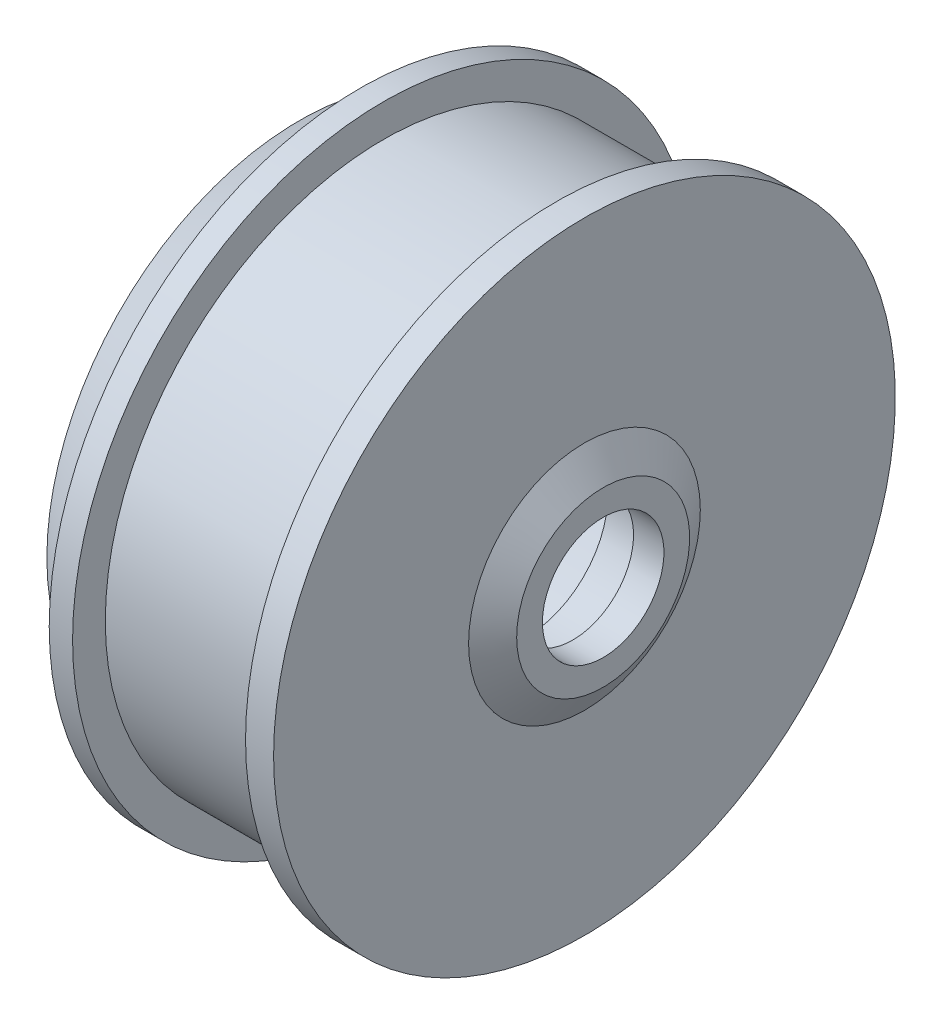
ISO-10303-21;
HEADER;
FILE_DESCRIPTION(('STEP AP214'),'2;1');
FILE_NAME('part.step','',(''),(''),'','','');
FILE_SCHEMA(('AUTOMOTIVE_DESIGN { 1 0 10303 214 1 1 1 1 }'));
ENDSEC;
DATA;
#1=APPLICATION_CONTEXT('core data for automotive mechanical design processes');
#2=APPLICATION_PROTOCOL_DEFINITION('international standard','automotive_design',2000,#1);
#3=PRODUCT_CONTEXT('',#1,'mechanical');
#4=PRODUCT('Part','Part','',(#3));
#5=PRODUCT_RELATED_PRODUCT_CATEGORY('part','',(#4));
#6=PRODUCT_DEFINITION_FORMATION('','',#4);
#7=PRODUCT_DEFINITION_CONTEXT('part definition',#1,'design');
#8=PRODUCT_DEFINITION('design','',#6,#7);
#9=PRODUCT_DEFINITION_SHAPE('','',#8);
#10=(LENGTH_UNIT() NAMED_UNIT(*) SI_UNIT(.MILLI.,.METRE.));
#11=(NAMED_UNIT(*) PLANE_ANGLE_UNIT() SI_UNIT($,.RADIAN.));
#12=(NAMED_UNIT(*) SI_UNIT($,.STERADIAN.) SOLID_ANGLE_UNIT());
#13=UNCERTAINTY_MEASURE_WITH_UNIT(LENGTH_MEASURE(1.E-05),#10,'distance_accuracy_value','');
#14=(GEOMETRIC_REPRESENTATION_CONTEXT(3) GLOBAL_UNCERTAINTY_ASSIGNED_CONTEXT((#13)) GLOBAL_UNIT_ASSIGNED_CONTEXT((#10,
#11,#12)) REPRESENTATION_CONTEXT('',''));
#15=CARTESIAN_POINT('',(0.,0.,0.));
#16=DIRECTION('',(0.,0.,1.));
#17=DIRECTION('',(1.,0.,0.));
#18=AXIS2_PLACEMENT_3D('',#15,#16,#17);
#19=CARTESIAN_POINT('',(22.5,0.,0.));
#20=DIRECTION('',(1.,0.,0.));
#21=DIRECTION('',(0.,0.,-1.));
#22=AXIS2_PLACEMENT_3D('',#19,#20,#21);
#23=PLANE('',#22);
#24=CARTESIAN_POINT('',(22.5,0.,0.));
#25=DIRECTION('',(-1.,0.,0.));
#26=DIRECTION('',(0.,0.,1.));
#27=AXIS2_PLACEMENT_3D('',#24,#25,#26);
#28=CIRCLE('',#27,13.);
#29=CARTESIAN_POINT('',(22.5,0.,13.));
#30=VERTEX_POINT('',#29);
#31=EDGE_CURVE('E11',#30,#30,#28,.T.);
#32=ORIENTED_EDGE('',*,*,#31,.F.);
#33=EDGE_LOOP('',(#32));
#34=FACE_BOUND('',#33,.T.);
#35=CARTESIAN_POINT('',(22.5,0.,0.));
#36=DIRECTION('',(-1.,0.,0.));
#37=DIRECTION('',(0.,0.,1.));
#38=AXIS2_PLACEMENT_3D('',#35,#36,#37);
#39=CIRCLE('',#38,17.5);
#40=CARTESIAN_POINT('',(22.5,0.,17.5));
#41=VERTEX_POINT('',#40);
#42=EDGE_CURVE('E89',#41,#41,#39,.T.);
#43=ORIENTED_EDGE('',*,*,#42,.T.);
#44=EDGE_LOOP('',(#43));
#45=FACE_BOUND('',#44,.T.);
#46=ADVANCED_FACE('F40',(#34,#45),#23,.F.);
#47=CARTESIAN_POINT('',(-84.605982481995,0.,0.));
#48=DIRECTION('',(-1.,0.,0.));
#49=DIRECTION('',(0.,0.,1.));
#50=AXIS2_PLACEMENT_3D('',#47,#48,#49);
#51=CYLINDRICAL_SURFACE('',#50,13.);
#52=CARTESIAN_POINT('',(29.,0.,0.));
#53=DIRECTION('',(-1.,0.,0.));
#54=DIRECTION('',(0.,0.,1.));
#55=AXIS2_PLACEMENT_3D('',#52,#53,#54);
#56=CIRCLE('',#55,13.);
#57=CARTESIAN_POINT('',(29.,0.,13.));
#58=VERTEX_POINT('',#57);
#59=EDGE_CURVE('E46',#58,#58,#56,.T.);
#60=ORIENTED_EDGE('',*,*,#59,.F.);
#61=EDGE_LOOP('',(#60));
#62=FACE_BOUND('',#61,.T.);
#63=ORIENTED_EDGE('',*,*,#31,.T.);
#64=EDGE_LOOP('',(#63));
#65=FACE_BOUND('',#64,.T.);
#66=ADVANCED_FACE('F118',(#62,#65),#51,.F.);
#67=CARTESIAN_POINT('',(29.,0.,0.));
#68=DIRECTION('',(-1.,0.,0.));
#69=DIRECTION('',(0.,0.,1.));
#70=AXIS2_PLACEMENT_3D('',#67,#68,#69);
#71=PLANE('',#70);
#72=CARTESIAN_POINT('',(29.,0.,0.));
#73=DIRECTION('',(-1.,0.,0.));
#74=DIRECTION('',(0.,0.,1.));
#75=AXIS2_PLACEMENT_3D('',#72,#73,#74);
#76=CIRCLE('',#75,18.5);
#77=CARTESIAN_POINT('',(29.,0.,18.5));
#78=VERTEX_POINT('',#77);
#79=EDGE_CURVE('E50',#78,#78,#76,.T.);
#80=ORIENTED_EDGE('',*,*,#79,.F.);
#81=EDGE_LOOP('',(#80));
#82=FACE_BOUND('',#81,.T.);
#83=ORIENTED_EDGE('',*,*,#59,.T.);
#84=EDGE_LOOP('',(#83));
#85=FACE_BOUND('',#84,.T.);
#86=ADVANCED_FACE('F123',(#82,#85),#71,.F.);
#87=CARTESIAN_POINT('',(29.,0.,0.));
#88=DIRECTION('',(-1.,0.,0.));
#89=DIRECTION('',(0.,0.,1.));
#90=AXIS2_PLACEMENT_3D('',#87,#88,#89);
#91=CONICAL_SURFACE('',#90,18.5,1.00406710927139);
#92=CARTESIAN_POINT('',(25.,0.,0.));
#93=DIRECTION('',(-1.,0.,0.));
#94=DIRECTION('',(0.,0.,1.));
#95=AXIS2_PLACEMENT_3D('',#92,#93,#94);
#96=CIRCLE('',#95,24.7857142857143);
#97=CARTESIAN_POINT('',(25.,0.,24.7857142857143));
#98=VERTEX_POINT('',#97);
#99=EDGE_CURVE('E54',#98,#98,#96,.T.);
#100=ORIENTED_EDGE('',*,*,#99,.F.);
#101=EDGE_LOOP('',(#100));
#102=FACE_BOUND('',#101,.T.);
#103=ORIENTED_EDGE('',*,*,#79,.T.);
#104=EDGE_LOOP('',(#103));
#105=FACE_BOUND('',#104,.T.);
#106=ADVANCED_FACE('F128',(#102,#105),#91,.T.);
#107=CARTESIAN_POINT('',(25.,0.,0.));
#108=DIRECTION('',(-1.,0.,0.));
#109=DIRECTION('',(0.,0.,1.));
#110=AXIS2_PLACEMENT_3D('',#107,#108,#109);
#111=PLANE('',#110);
#112=CARTESIAN_POINT('',(25.,0.,0.));
#113=DIRECTION('',(-1.,0.,0.));
#114=DIRECTION('',(0.,0.,1.));
#115=AXIS2_PLACEMENT_3D('',#112,#113,#114);
#116=CIRCLE('',#115,66.5);
#117=CARTESIAN_POINT('',(25.,0.,66.5));
#118=VERTEX_POINT('',#117);
#119=EDGE_CURVE('E59',#118,#118,#116,.T.);
#120=ORIENTED_EDGE('',*,*,#119,.F.);
#121=EDGE_LOOP('',(#120));
#122=FACE_BOUND('',#121,.T.);
#123=ORIENTED_EDGE('',*,*,#99,.T.);
#124=EDGE_LOOP('',(#123));
#125=FACE_BOUND('',#124,.T.);
#126=ADVANCED_FACE('F134',(#122,#125),#111,.F.);
#127=CARTESIAN_POINT('',(-84.605982481995,0.,0.));
#128=DIRECTION('',(-1.,0.,0.));
#129=DIRECTION('',(0.,0.,1.));
#130=AXIS2_PLACEMENT_3D('',#127,#128,#129);
#131=CYLINDRICAL_SURFACE('',#130,66.5);
#132=CARTESIAN_POINT('',(19.,0.,0.));
#133=DIRECTION('',(-1.,0.,0.));
#134=DIRECTION('',(0.,0.,1.));
#135=AXIS2_PLACEMENT_3D('',#132,#133,#134);
#136=CIRCLE('',#135,66.5);
#137=CARTESIAN_POINT('',(19.,0.,66.5));
#138=VERTEX_POINT('',#137);
#139=EDGE_CURVE('E62',#138,#138,#136,.T.);
#140=ORIENTED_EDGE('',*,*,#139,.F.);
#141=EDGE_LOOP('',(#140));
#142=FACE_BOUND('',#141,.T.);
#143=ORIENTED_EDGE('',*,*,#119,.T.);
#144=EDGE_LOOP('',(#143));
#145=FACE_BOUND('',#144,.T.);
#146=ADVANCED_FACE('F138',(#142,#145),#131,.T.);
#147=CARTESIAN_POINT('',(19.,0.,0.));
#148=DIRECTION('',(1.,0.,0.));
#149=DIRECTION('',(0.,0.,-1.));
#150=AXIS2_PLACEMENT_3D('',#147,#148,#149);
#151=PLANE('',#150);
#152=CARTESIAN_POINT('',(19.,0.,0.));
#153=DIRECTION('',(-1.,0.,0.));
#154=DIRECTION('',(0.,0.,1.));
#155=AXIS2_PLACEMENT_3D('',#152,#153,#154);
#156=CIRCLE('',#155,53.);
#157=CARTESIAN_POINT('',(19.,0.,53.));
#158=VERTEX_POINT('',#157);
#159=EDGE_CURVE('E65',#158,#158,#156,.T.);
#160=ORIENTED_EDGE('',*,*,#159,.F.);
#161=EDGE_LOOP('',(#160));
#162=FACE_BOUND('',#161,.T.);
#163=ORIENTED_EDGE('',*,*,#139,.T.);
#164=EDGE_LOOP('',(#163));
#165=FACE_BOUND('',#164,.T.);
#166=ADVANCED_FACE('F142',(#162,#165),#151,.F.);
#167=CARTESIAN_POINT('',(-84.605982481995,0.,0.));
#168=DIRECTION('',(-1.,0.,0.));
#169=DIRECTION('',(0.,0.,1.));
#170=AXIS2_PLACEMENT_3D('',#167,#168,#169);
#171=CYLINDRICAL_SURFACE('',#170,53.);
#172=CARTESIAN_POINT('',(15.5,0.,0.));
#173=DIRECTION('',(-1.,0.,0.));
#174=DIRECTION('',(0.,0.,1.));
#175=AXIS2_PLACEMENT_3D('',#172,#173,#174);
#176=CIRCLE('',#175,53.);
#177=CARTESIAN_POINT('',(15.5,0.,53.));
#178=VERTEX_POINT('',#177);
#179=EDGE_CURVE('E68',#178,#178,#176,.T.);
#180=ORIENTED_EDGE('',*,*,#179,.F.);
#181=EDGE_LOOP('',(#180));
#182=FACE_BOUND('',#181,.T.);
#183=ORIENTED_EDGE('',*,*,#159,.T.);
#184=EDGE_LOOP('',(#183));
#185=FACE_BOUND('',#184,.T.);
#186=ADVANCED_FACE('F146',(#182,#185),#171,.T.);
#187=CARTESIAN_POINT('',(15.5,0.,0.));
#188=DIRECTION('',(1.,0.,0.));
#189=DIRECTION('',(0.,0.,-1.));
#190=AXIS2_PLACEMENT_3D('',#187,#188,#189);
#191=PLANE('',#190);
#192=CARTESIAN_POINT('',(15.5,0.,0.));
#193=DIRECTION('',(-1.,0.,0.));
#194=DIRECTION('',(0.,0.,1.));
#195=AXIS2_PLACEMENT_3D('',#192,#193,#194);
#196=CIRCLE('',#195,50.5);
#197=CARTESIAN_POINT('',(15.5,0.,50.5));
#198=VERTEX_POINT('',#197);
#199=EDGE_CURVE('E71',#198,#198,#196,.T.);
#200=ORIENTED_EDGE('',*,*,#199,.F.);
#201=EDGE_LOOP('',(#200));
#202=FACE_BOUND('',#201,.T.);
#203=ORIENTED_EDGE('',*,*,#179,.T.);
#204=EDGE_LOOP('',(#203));
#205=FACE_BOUND('',#204,.T.);
#206=ADVANCED_FACE('F150',(#202,#205),#191,.F.);
#207=CARTESIAN_POINT('',(-84.605982481995,0.,0.));
#208=DIRECTION('',(-1.,0.,0.));
#209=DIRECTION('',(0.,0.,1.));
#210=AXIS2_PLACEMENT_3D('',#207,#208,#209);
#211=CYLINDRICAL_SURFACE('',#210,50.5);
#212=CARTESIAN_POINT('',(22.5,0.,0.));
#213=DIRECTION('',(-1.,0.,0.));
#214=DIRECTION('',(0.,0.,1.));
#215=AXIS2_PLACEMENT_3D('',#212,#213,#214);
#216=CIRCLE('',#215,50.5);
#217=CARTESIAN_POINT('',(22.5,0.,50.5));
#218=VERTEX_POINT('',#217);
#219=EDGE_CURVE('E74',#218,#218,#216,.T.);
#220=ORIENTED_EDGE('',*,*,#219,.F.);
#221=EDGE_LOOP('',(#220));
#222=FACE_BOUND('',#221,.T.);
#223=ORIENTED_EDGE('',*,*,#199,.T.);
#224=EDGE_LOOP('',(#223));
#225=FACE_BOUND('',#224,.T.);
#226=ADVANCED_FACE('F154',(#222,#225),#211,.F.);
#227=CARTESIAN_POINT('',(22.5,0.,0.));
#228=DIRECTION('',(1.,0.,0.));
#229=DIRECTION('',(0.,0.,-1.));
#230=AXIS2_PLACEMENT_3D('',#227,#228,#229);
#231=PLANE('',#230);
#232=CARTESIAN_POINT('',(22.5,0.,0.));
#233=DIRECTION('',(-1.,0.,0.));
#234=DIRECTION('',(0.,0.,1.));
#235=AXIS2_PLACEMENT_3D('',#232,#233,#234);
#236=CIRCLE('',#235,22.5);
#237=CARTESIAN_POINT('',(22.5,0.,22.5));
#238=VERTEX_POINT('',#237);
#239=EDGE_CURVE('E77',#238,#238,#236,.T.);
#240=ORIENTED_EDGE('',*,*,#239,.F.);
#241=EDGE_LOOP('',(#240));
#242=FACE_BOUND('',#241,.T.);
#243=ORIENTED_EDGE('',*,*,#219,.T.);
#244=EDGE_LOOP('',(#243));
#245=FACE_BOUND('',#244,.T.);
#246=ADVANCED_FACE('F114',(#242,#245),#231,.F.);
#247=CARTESIAN_POINT('',(-84.605982481995,0.,0.));
#248=DIRECTION('',(-1.,0.,0.));
#249=DIRECTION('',(0.,0.,1.));
#250=AXIS2_PLACEMENT_3D('',#247,#248,#249);
#251=CYLINDRICAL_SURFACE('',#250,22.5);
#252=ORIENTED_EDGE('',*,*,#239,.T.);
#253=EDGE_LOOP('',(#252));
#254=FACE_BOUND('',#253,.T.);
#255=CARTESIAN_POINT('',(18.,0.,0.));
#256=DIRECTION('',(-1.,0.,0.));
#257=DIRECTION('',(0.,0.,1.));
#258=AXIS2_PLACEMENT_3D('',#255,#256,#257);
#259=CIRCLE('',#258,22.5);
#260=CARTESIAN_POINT('',(18.,0.,22.5));
#261=VERTEX_POINT('',#260);
#262=EDGE_CURVE('E80',#261,#261,#259,.T.);
#263=ORIENTED_EDGE('',*,*,#262,.F.);
#264=EDGE_LOOP('',(#263));
#265=FACE_BOUND('',#264,.T.);
#266=ADVANCED_FACE('F108',(#254,#265),#251,.T.);
#267=CARTESIAN_POINT('',(12.5,0.,0.));
#268=DIRECTION('',(1.,0.,0.));
#269=DIRECTION('',(0.,0.,-1.));
#270=AXIS2_PLACEMENT_3D('',#267,#268,#269);
#271=CONICAL_SURFACE('',#270,19.,0.566729217523506);
#272=ORIENTED_EDGE('',*,*,#262,.T.);
#273=EDGE_LOOP('',(#272));
#274=FACE_BOUND('',#273,.T.);
#275=CARTESIAN_POINT('',(12.5,0.,0.));
#276=DIRECTION('',(-1.,0.,0.));
#277=DIRECTION('',(0.,0.,1.));
#278=AXIS2_PLACEMENT_3D('',#275,#276,#277);
#279=CIRCLE('',#278,19.);
#280=CARTESIAN_POINT('',(12.5,0.,19.));
#281=VERTEX_POINT('',#280);
#282=EDGE_CURVE('E83',#281,#281,#279,.T.);
#283=ORIENTED_EDGE('',*,*,#282,.F.);
#284=EDGE_LOOP('',(#283));
#285=FACE_BOUND('',#284,.T.);
#286=ADVANCED_FACE('F103',(#274,#285),#271,.T.);
#287=CARTESIAN_POINT('',(12.5,0.,0.));
#288=DIRECTION('',(1.,0.,0.));
#289=DIRECTION('',(0.,0.,-1.));
#290=AXIS2_PLACEMENT_3D('',#287,#288,#289);
#291=PLANE('',#290);
#292=CARTESIAN_POINT('',(12.5,0.,0.));
#293=DIRECTION('',(-1.,0.,0.));
#294=DIRECTION('',(0.,0.,1.));
#295=AXIS2_PLACEMENT_3D('',#292,#293,#294);
#296=CIRCLE('',#295,17.5);
#297=CARTESIAN_POINT('',(12.5,0.,17.5));
#298=VERTEX_POINT('',#297);
#299=EDGE_CURVE('E86',#298,#298,#296,.T.);
#300=ORIENTED_EDGE('',*,*,#299,.F.);
#301=EDGE_LOOP('',(#300));
#302=FACE_BOUND('',#301,.T.);
#303=ORIENTED_EDGE('',*,*,#282,.T.);
#304=EDGE_LOOP('',(#303));
#305=FACE_BOUND('',#304,.T.);
#306=ADVANCED_FACE('F97',(#302,#305),#291,.F.);
#307=CARTESIAN_POINT('',(-84.605982481995,0.,0.));
#308=DIRECTION('',(-1.,0.,0.));
#309=DIRECTION('',(0.,0.,1.));
#310=AXIS2_PLACEMENT_3D('',#307,#308,#309);
#311=CYLINDRICAL_SURFACE('',#310,17.5);
#312=ORIENTED_EDGE('',*,*,#42,.F.);
#313=EDGE_LOOP('',(#312));
#314=FACE_BOUND('',#313,.T.);
#315=ORIENTED_EDGE('',*,*,#299,.T.);
#316=EDGE_LOOP('',(#315));
#317=FACE_BOUND('',#316,.T.);
#318=ADVANCED_FACE('F94',(#314,#317),#311,.F.);
#319=CLOSED_SHELL('',(#46,#66,#86,#106,#126,#146,#166,#186,#206,#226,#246,#266,#286,#306,#318));
#320=MANIFOLD_SOLID_BREP('B2',#319);
#321=CARTESIAN_POINT('',(19.,59.5,0.));
#322=DIRECTION('',(1.,0.,0.));
#323=DIRECTION('',(0.,0.,-1.));
#324=AXIS2_PLACEMENT_3D('',#321,#322,#323);
#325=PLANE('',#324);
#326=CARTESIAN_POINT('',(19.,0.,0.));
#327=DIRECTION('',(-1.,0.,0.));
#328=DIRECTION('',(0.,0.,1.));
#329=AXIS2_PLACEMENT_3D('',#326,#327,#328);
#330=CIRCLE('',#329,53.);
#331=CARTESIAN_POINT('',(19.,0.,53.));
#332=VERTEX_POINT('',#331);
#333=EDGE_CURVE('E39',#332,#332,#330,.T.);
#334=ORIENTED_EDGE('',*,*,#333,.T.);
#335=EDGE_LOOP('',(#334));
#336=FACE_BOUND('',#335,.T.);
#337=CARTESIAN_POINT('',(19.,0.,0.));
#338=DIRECTION('',(-1.,0.,0.));
#339=DIRECTION('',(0.,0.,1.));
#340=AXIS2_PLACEMENT_3D('',#337,#338,#339);
#341=CIRCLE('',#340,59.5);
#342=CARTESIAN_POINT('',(19.,0.,59.5));
#343=VERTEX_POINT('',#342);
#344=EDGE_CURVE('E315',#343,#343,#341,.T.);
#345=ORIENTED_EDGE('',*,*,#344,.F.);
#346=EDGE_LOOP('',(#345));
#347=FACE_BOUND('',#346,.T.);
#348=ADVANCED_FACE('F269',(#336,#347),#325,.T.);
#349=CARTESIAN_POINT('',(-84.605982481995,0.,0.));
#350=DIRECTION('',(-1.,0.,0.));
#351=DIRECTION('',(0.,0.,1.));
#352=AXIS2_PLACEMENT_3D('',#349,#350,#351);
#353=CYLINDRICAL_SURFACE('',#352,53.);
#354=CARTESIAN_POINT('',(-28.,0.,0.));
#355=DIRECTION('',(-1.,0.,0.));
#356=DIRECTION('',(0.,0.,1.));
#357=AXIS2_PLACEMENT_3D('',#354,#355,#356);
#358=CIRCLE('',#357,53.);
#359=CARTESIAN_POINT('',(-28.,0.,53.));
#360=VERTEX_POINT('',#359);
#361=EDGE_CURVE('E275',#360,#360,#358,.T.);
#362=ORIENTED_EDGE('',*,*,#361,.T.);
#363=EDGE_LOOP('',(#362));
#364=FACE_BOUND('',#363,.T.);
#365=ORIENTED_EDGE('',*,*,#333,.F.);
#366=EDGE_LOOP('',(#365));
#367=FACE_BOUND('',#366,.T.);
#368=ADVANCED_FACE('F323',(#364,#367),#353,.F.);
#369=CARTESIAN_POINT('',(-28.,53.,0.));
#370=DIRECTION('',(1.,0.,0.));
#371=DIRECTION('',(0.,0.,-1.));
#372=AXIS2_PLACEMENT_3D('',#369,#370,#371);
#373=PLANE('',#372);
#374=CARTESIAN_POINT('',(-28.,0.,0.));
#375=DIRECTION('',(-1.,0.,0.));
#376=DIRECTION('',(0.,0.,1.));
#377=AXIS2_PLACEMENT_3D('',#374,#375,#376);
#378=CIRCLE('',#377,22.5);
#379=CARTESIAN_POINT('',(-28.,0.,22.5));
#380=VERTEX_POINT('',#379);
#381=EDGE_CURVE('E279',#380,#380,#378,.T.);
#382=ORIENTED_EDGE('',*,*,#381,.T.);
#383=EDGE_LOOP('',(#382));
#384=FACE_BOUND('',#383,.T.);
#385=ORIENTED_EDGE('',*,*,#361,.F.);
#386=EDGE_LOOP('',(#385));
#387=FACE_BOUND('',#386,.T.);
#388=ADVANCED_FACE('F327',(#384,#387),#373,.T.);
#389=CARTESIAN_POINT('',(-84.605982481995,0.,0.));
#390=DIRECTION('',(-1.,0.,0.));
#391=DIRECTION('',(0.,0.,1.));
#392=AXIS2_PLACEMENT_3D('',#389,#390,#391);
#393=CYLINDRICAL_SURFACE('',#392,22.5);
#394=CARTESIAN_POINT('',(-14.5,0.,0.));
#395=DIRECTION('',(-1.,0.,0.));
#396=DIRECTION('',(0.,0.,1.));
#397=AXIS2_PLACEMENT_3D('',#394,#395,#396);
#398=CIRCLE('',#397,22.5);
#399=CARTESIAN_POINT('',(-14.5,0.,22.5));
#400=VERTEX_POINT('',#399);
#401=EDGE_CURVE('E283',#400,#400,#398,.T.);
#402=ORIENTED_EDGE('',*,*,#401,.T.);
#403=EDGE_LOOP('',(#402));
#404=FACE_BOUND('',#403,.T.);
#405=ORIENTED_EDGE('',*,*,#381,.F.);
#406=EDGE_LOOP('',(#405));
#407=FACE_BOUND('',#406,.T.);
#408=ADVANCED_FACE('F331',(#404,#407),#393,.T.);
#409=CARTESIAN_POINT('',(-14.5,22.5,0.));
#410=DIRECTION('',(1.,0.,0.));
#411=DIRECTION('',(0.,0.,-1.));
#412=AXIS2_PLACEMENT_3D('',#409,#410,#411);
#413=PLANE('',#412);
#414=CARTESIAN_POINT('',(-14.5,0.,0.));
#415=DIRECTION('',(-1.,0.,0.));
#416=DIRECTION('',(0.,0.,1.));
#417=AXIS2_PLACEMENT_3D('',#414,#415,#416);
#418=CIRCLE('',#417,17.5);
#419=CARTESIAN_POINT('',(-14.5,0.,17.5));
#420=VERTEX_POINT('',#419);
#421=EDGE_CURVE('E288',#420,#420,#418,.T.);
#422=ORIENTED_EDGE('',*,*,#421,.T.);
#423=EDGE_LOOP('',(#422));
#424=FACE_BOUND('',#423,.T.);
#425=ORIENTED_EDGE('',*,*,#401,.F.);
#426=EDGE_LOOP('',(#425));
#427=FACE_BOUND('',#426,.T.);
#428=ADVANCED_FACE('F338',(#424,#427),#413,.T.);
#429=CARTESIAN_POINT('',(-84.605982481995,0.,0.));
#430=DIRECTION('',(-1.,0.,0.));
#431=DIRECTION('',(0.,0.,1.));
#432=AXIS2_PLACEMENT_3D('',#429,#430,#431);
#433=CYLINDRICAL_SURFACE('',#432,17.5);
#434=CARTESIAN_POINT('',(-24.5,0.,0.));
#435=DIRECTION('',(-1.,0.,0.));
#436=DIRECTION('',(0.,0.,1.));
#437=AXIS2_PLACEMENT_3D('',#434,#435,#436);
#438=CIRCLE('',#437,17.5);
#439=CARTESIAN_POINT('',(-24.5,0.,17.5));
#440=VERTEX_POINT('',#439);
#441=EDGE_CURVE('E291',#440,#440,#438,.T.);
#442=ORIENTED_EDGE('',*,*,#441,.T.);
#443=EDGE_LOOP('',(#442));
#444=FACE_BOUND('',#443,.T.);
#445=ORIENTED_EDGE('',*,*,#421,.F.);
#446=EDGE_LOOP('',(#445));
#447=FACE_BOUND('',#446,.T.);
#448=ADVANCED_FACE('F342',(#444,#447),#433,.F.);
#449=CARTESIAN_POINT('',(-24.5,17.5,0.));
#450=DIRECTION('',(1.,0.,0.));
#451=DIRECTION('',(0.,0.,-1.));
#452=AXIS2_PLACEMENT_3D('',#449,#450,#451);
#453=PLANE('',#452);
#454=CARTESIAN_POINT('',(-24.5,0.,0.));
#455=DIRECTION('',(-1.,0.,0.));
#456=DIRECTION('',(0.,0.,1.));
#457=AXIS2_PLACEMENT_3D('',#454,#455,#456);
#458=CIRCLE('',#457,14.5);
#459=CARTESIAN_POINT('',(-24.5,0.,14.5));
#460=VERTEX_POINT('',#459);
#461=EDGE_CURVE('E294',#460,#460,#458,.T.);
#462=ORIENTED_EDGE('',*,*,#461,.T.);
#463=EDGE_LOOP('',(#462));
#464=FACE_BOUND('',#463,.T.);
#465=ORIENTED_EDGE('',*,*,#441,.F.);
#466=EDGE_LOOP('',(#465));
#467=FACE_BOUND('',#466,.T.);
#468=ADVANCED_FACE('F346',(#464,#467),#453,.T.);
#469=CARTESIAN_POINT('',(-84.605982481995,0.,0.));
#470=DIRECTION('',(-1.,0.,0.));
#471=DIRECTION('',(0.,0.,1.));
#472=AXIS2_PLACEMENT_3D('',#469,#470,#471);
#473=CYLINDRICAL_SURFACE('',#472,14.5);
#474=CARTESIAN_POINT('',(-28.,0.,0.));
#475=DIRECTION('',(-1.,0.,0.));
#476=DIRECTION('',(0.,0.,1.));
#477=AXIS2_PLACEMENT_3D('',#474,#475,#476);
#478=CIRCLE('',#477,14.5);
#479=CARTESIAN_POINT('',(-28.,0.,14.5));
#480=VERTEX_POINT('',#479);
#481=EDGE_CURVE('E297',#480,#480,#478,.T.);
#482=ORIENTED_EDGE('',*,*,#481,.T.);
#483=EDGE_LOOP('',(#482));
#484=FACE_BOUND('',#483,.T.);
#485=ORIENTED_EDGE('',*,*,#461,.F.);
#486=EDGE_LOOP('',(#485));
#487=FACE_BOUND('',#486,.T.);
#488=ADVANCED_FACE('F350',(#484,#487),#473,.F.);
#489=CARTESIAN_POINT('',(-28.,14.5,0.));
#490=DIRECTION('',(1.,0.,0.));
#491=DIRECTION('',(0.,0.,-1.));
#492=AXIS2_PLACEMENT_3D('',#489,#490,#491);
#493=PLANE('',#492);
#494=ORIENTED_EDGE('',*,*,#481,.F.);
#495=EDGE_LOOP('',(#494));
#496=FACE_BOUND('',#495,.T.);
#497=ADVANCED_FACE('F354',(#496),#493,.T.);
#498=CARTESIAN_POINT('',(-36.,0.,0.));
#499=DIRECTION('',(-1.,0.,0.));
#500=DIRECTION('',(0.,0.,1.));
#501=AXIS2_PLACEMENT_3D('',#498,#499,#500);
#502=PLANE('',#501);
#503=CARTESIAN_POINT('',(-36.,0.,0.));
#504=DIRECTION('',(-1.,0.,0.));
#505=DIRECTION('',(0.,0.,1.));
#506=AXIS2_PLACEMENT_3D('',#503,#504,#505);
#507=CIRCLE('',#506,54.);
#508=CARTESIAN_POINT('',(-36.,0.,54.));
#509=VERTEX_POINT('',#508);
#510=EDGE_CURVE('E300',#509,#509,#507,.T.);
#511=ORIENTED_EDGE('',*,*,#510,.T.);
#512=EDGE_LOOP('',(#511));
#513=FACE_BOUND('',#512,.T.);
#514=ADVANCED_FACE('F358',(#513),#502,.T.);
#515=CARTESIAN_POINT('',(-36.,0.,0.));
#516=DIRECTION('',(1.,0.,0.));
#517=DIRECTION('',(0.,0.,-1.));
#518=AXIS2_PLACEMENT_3D('',#515,#516,#517);
#519=CONICAL_SURFACE('',#518,54.,0.60554466360497);
#520=CARTESIAN_POINT('',(-23.,0.,0.));
#521=DIRECTION('',(-1.,0.,0.));
#522=DIRECTION('',(0.,0.,1.));
#523=AXIS2_PLACEMENT_3D('',#520,#521,#522);
#524=CIRCLE('',#523,63.);
#525=CARTESIAN_POINT('',(-23.,0.,63.));
#526=VERTEX_POINT('',#525);
#527=EDGE_CURVE('E303',#526,#526,#524,.T.);
#528=ORIENTED_EDGE('',*,*,#527,.T.);
#529=EDGE_LOOP('',(#528));
#530=FACE_BOUND('',#529,.T.);
#531=ORIENTED_EDGE('',*,*,#510,.F.);
#532=EDGE_LOOP('',(#531));
#533=FACE_BOUND('',#532,.T.);
#534=ADVANCED_FACE('F362',(#530,#533),#519,.T.);
#535=CARTESIAN_POINT('',(-23.,63.,0.));
#536=DIRECTION('',(-1.,0.,0.));
#537=DIRECTION('',(0.,0.,1.));
#538=AXIS2_PLACEMENT_3D('',#535,#536,#537);
#539=PLANE('',#538);
#540=CARTESIAN_POINT('',(-23.,0.,0.));
#541=DIRECTION('',(-1.,0.,0.));
#542=DIRECTION('',(0.,0.,1.));
#543=AXIS2_PLACEMENT_3D('',#540,#541,#542);
#544=CIRCLE('',#543,66.5);
#545=CARTESIAN_POINT('',(-23.,0.,66.5));
#546=VERTEX_POINT('',#545);
#547=EDGE_CURVE('E306',#546,#546,#544,.T.);
#548=ORIENTED_EDGE('',*,*,#547,.T.);
#549=EDGE_LOOP('',(#548));
#550=FACE_BOUND('',#549,.T.);
#551=ORIENTED_EDGE('',*,*,#527,.F.);
#552=EDGE_LOOP('',(#551));
#553=FACE_BOUND('',#552,.T.);
#554=ADVANCED_FACE('F366',(#550,#553),#539,.T.);
#555=CARTESIAN_POINT('',(-84.605982481995,0.,0.));
#556=DIRECTION('',(-1.,0.,0.));
#557=DIRECTION('',(0.,0.,1.));
#558=AXIS2_PLACEMENT_3D('',#555,#556,#557);
#559=CYLINDRICAL_SURFACE('',#558,66.5);
#560=CARTESIAN_POINT('',(-18.,0.,0.));
#561=DIRECTION('',(-1.,0.,0.));
#562=DIRECTION('',(0.,0.,1.));
#563=AXIS2_PLACEMENT_3D('',#560,#561,#562);
#564=CIRCLE('',#563,66.5);
#565=CARTESIAN_POINT('',(-18.,0.,66.5));
#566=VERTEX_POINT('',#565);
#567=EDGE_CURVE('E309',#566,#566,#564,.T.);
#568=ORIENTED_EDGE('',*,*,#567,.T.);
#569=EDGE_LOOP('',(#568));
#570=FACE_BOUND('',#569,.T.);
#571=ORIENTED_EDGE('',*,*,#547,.F.);
#572=EDGE_LOOP('',(#571));
#573=FACE_BOUND('',#572,.T.);
#574=ADVANCED_FACE('F370',(#570,#573),#559,.T.);
#575=CARTESIAN_POINT('',(-18.,66.5,0.));
#576=DIRECTION('',(1.,0.,0.));
#577=DIRECTION('',(0.,0.,-1.));
#578=AXIS2_PLACEMENT_3D('',#575,#576,#577);
#579=PLANE('',#578);
#580=CARTESIAN_POINT('',(-18.,0.,0.));
#581=DIRECTION('',(-1.,0.,0.));
#582=DIRECTION('',(0.,0.,1.));
#583=AXIS2_PLACEMENT_3D('',#580,#581,#582);
#584=CIRCLE('',#583,59.5);
#585=CARTESIAN_POINT('',(-18.,0.,59.5));
#586=VERTEX_POINT('',#585);
#587=EDGE_CURVE('E312',#586,#586,#584,.T.);
#588=ORIENTED_EDGE('',*,*,#587,.T.);
#589=EDGE_LOOP('',(#588));
#590=FACE_BOUND('',#589,.T.);
#591=ORIENTED_EDGE('',*,*,#567,.F.);
#592=EDGE_LOOP('',(#591));
#593=FACE_BOUND('',#592,.T.);
#594=ADVANCED_FACE('F374',(#590,#593),#579,.T.);
#595=CARTESIAN_POINT('',(-84.605982481995,0.,0.));
#596=DIRECTION('',(-1.,0.,0.));
#597=DIRECTION('',(0.,0.,1.));
#598=AXIS2_PLACEMENT_3D('',#595,#596,#597);
#599=CYLINDRICAL_SURFACE('',#598,59.5);
#600=ORIENTED_EDGE('',*,*,#344,.T.);
#601=EDGE_LOOP('',(#600));
#602=FACE_BOUND('',#601,.T.);
#603=ORIENTED_EDGE('',*,*,#587,.F.);
#604=EDGE_LOOP('',(#603));
#605=FACE_BOUND('',#604,.T.);
#606=ADVANCED_FACE('F319',(#602,#605),#599,.T.);
#607=CLOSED_SHELL('',(#348,#368,#388,#408,#428,#448,#468,#488,#497,#514,#534,#554,#574,#594,#606));
#608=MANIFOLD_SOLID_BREP('B6',#607);
#609=ADVANCED_BREP_SHAPE_REPRESENTATION('',(#18,#320,#608),#14);
#610=SHAPE_DEFINITION_REPRESENTATION(#9,#609);
ENDSEC;
END-ISO-10303-21;
